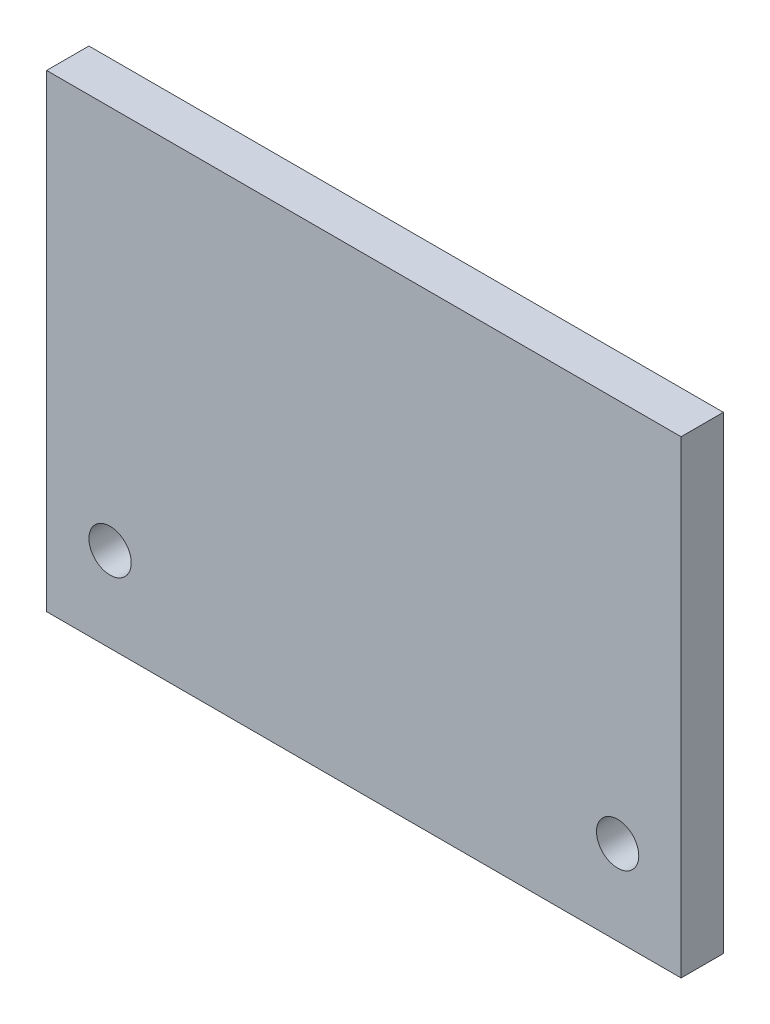
ISO-10303-21;
HEADER;
FILE_DESCRIPTION(('STEP AP214'),'2;1');
FILE_NAME('part.step','',(''),(''),'','','');
FILE_SCHEMA(('AUTOMOTIVE_DESIGN { 1 0 10303 214 1 1 1 1 }'));
ENDSEC;
DATA;
#1=APPLICATION_CONTEXT('core data for automotive mechanical design processes');
#2=APPLICATION_PROTOCOL_DEFINITION('international standard','automotive_design',2000,#1);
#3=PRODUCT_CONTEXT('',#1,'mechanical');
#4=PRODUCT('Part','Part','',(#3));
#5=PRODUCT_RELATED_PRODUCT_CATEGORY('part','',(#4));
#6=PRODUCT_DEFINITION_FORMATION('','',#4);
#7=PRODUCT_DEFINITION_CONTEXT('part definition',#1,'design');
#8=PRODUCT_DEFINITION('design','',#6,#7);
#9=PRODUCT_DEFINITION_SHAPE('','',#8);
#10=(LENGTH_UNIT() NAMED_UNIT(*) SI_UNIT(.MILLI.,.METRE.));
#11=(NAMED_UNIT(*) PLANE_ANGLE_UNIT() SI_UNIT($,.RADIAN.));
#12=(NAMED_UNIT(*) SI_UNIT($,.STERADIAN.) SOLID_ANGLE_UNIT());
#13=UNCERTAINTY_MEASURE_WITH_UNIT(LENGTH_MEASURE(1.E-05),#10,'distance_accuracy_value','');
#14=(GEOMETRIC_REPRESENTATION_CONTEXT(3) GLOBAL_UNCERTAINTY_ASSIGNED_CONTEXT((#13)) GLOBAL_UNIT_ASSIGNED_CONTEXT((#10,
#11,#12)) REPRESENTATION_CONTEXT('',''));
#15=CARTESIAN_POINT('',(0.,0.,0.));
#16=DIRECTION('',(0.,0.,1.));
#17=DIRECTION('',(1.,0.,0.));
#18=AXIS2_PLACEMENT_3D('',#15,#16,#17);
#19=CARTESIAN_POINT('',(-6.35,98.5775396286338,-6.35));
#20=DIRECTION('',(-1.,0.,0.));
#21=DIRECTION('',(0.,0.,1.));
#22=AXIS2_PLACEMENT_3D('',#19,#20,#21);
#23=PLANE('',#22);
#24=DIRECTION('',(0.,-1.,0.));
#25=VECTOR('',#24,1.);
#26=CARTESIAN_POINT('',(-6.35,98.5775396286338,0.));
#27=LINE('',#26,#25);
#28=CARTESIAN_POINT('',(-6.35,98.5775396286338,0.));
#29=VERTEX_POINT('',#28);
#30=CARTESIAN_POINT('',(-6.35,28.2029783203332,0.));
#31=VERTEX_POINT('',#30);
#32=EDGE_CURVE('E99',#29,#31,#27,.T.);
#33=ORIENTED_EDGE('',*,*,#32,.F.);
#34=DIRECTION('',(0.,0.,1.));
#35=VECTOR('',#34,1.);
#36=CARTESIAN_POINT('',(-6.35,98.5775396286338,-6.35));
#37=LINE('',#36,#35);
#38=CARTESIAN_POINT('',(-6.35,98.5775396286338,-6.35));
#39=VERTEX_POINT('',#38);
#40=EDGE_CURVE('E11',#39,#29,#37,.T.);
#41=ORIENTED_EDGE('',*,*,#40,.F.);
#42=DIRECTION('',(0.,-1.,0.));
#43=VECTOR('',#42,1.);
#44=CARTESIAN_POINT('',(-6.35,98.5775396286338,-6.35));
#45=LINE('',#44,#43);
#46=CARTESIAN_POINT('',(-6.35,28.2029783203332,-6.35));
#47=VERTEX_POINT('',#46);
#48=EDGE_CURVE('E93',#39,#47,#45,.T.);
#49=ORIENTED_EDGE('',*,*,#48,.T.);
#50=DIRECTION('',(0.,0.,1.));
#51=VECTOR('',#50,1.);
#52=CARTESIAN_POINT('',(-6.35,28.2029783203332,-6.35));
#53=LINE('',#52,#51);
#54=EDGE_CURVE('E36',#47,#31,#53,.T.);
#55=ORIENTED_EDGE('',*,*,#54,.T.);
#56=EDGE_LOOP('',(#33,#41,#49,#55));
#57=FACE_BOUND('',#56,.T.);
#58=ADVANCED_FACE('F33',(#57),#23,.T.);
#59=CARTESIAN_POINT('',(-6.35,98.5775396286338,-6.35));
#60=DIRECTION('',(0.,-1.,0.));
#61=DIRECTION('',(0.,0.,-1.));
#62=AXIS2_PLACEMENT_3D('',#59,#60,#61);
#63=PLANE('',#62);
#64=DIRECTION('',(1.,0.,0.));
#65=VECTOR('',#64,1.);
#66=CARTESIAN_POINT('',(-6.35,98.5775396286338,0.));
#67=LINE('',#66,#65);
#68=CARTESIAN_POINT('',(88.9,98.5775396286338,0.));
#69=VERTEX_POINT('',#68);
#70=EDGE_CURVE('E66',#29,#69,#67,.T.);
#71=ORIENTED_EDGE('',*,*,#70,.T.);
#72=DIRECTION('',(0.,0.,1.));
#73=VECTOR('',#72,1.);
#74=CARTESIAN_POINT('',(88.9,98.5775396286338,-6.35));
#75=LINE('',#74,#73);
#76=CARTESIAN_POINT('',(88.9,98.5775396286338,-6.35));
#77=VERTEX_POINT('',#76);
#78=EDGE_CURVE('E42',#77,#69,#75,.T.);
#79=ORIENTED_EDGE('',*,*,#78,.F.);
#80=DIRECTION('',(1.,0.,0.));
#81=VECTOR('',#80,1.);
#82=CARTESIAN_POINT('',(-6.35,98.5775396286338,-6.35));
#83=LINE('',#82,#81);
#84=EDGE_CURVE('E83',#39,#77,#83,.T.);
#85=ORIENTED_EDGE('',*,*,#84,.F.);
#86=ORIENTED_EDGE('',*,*,#40,.T.);
#87=EDGE_LOOP('',(#71,#79,#85,#86));
#88=FACE_BOUND('',#87,.T.);
#89=ADVANCED_FACE('F110',(#88),#63,.F.);
#90=CARTESIAN_POINT('',(88.9,98.5775396286338,-6.35));
#91=DIRECTION('',(-1.,0.,0.));
#92=DIRECTION('',(0.,0.,1.));
#93=AXIS2_PLACEMENT_3D('',#90,#91,#92);
#94=PLANE('',#93);
#95=DIRECTION('',(0.,-1.,0.));
#96=VECTOR('',#95,1.);
#97=CARTESIAN_POINT('',(88.9,98.5775396286338,0.));
#98=LINE('',#97,#96);
#99=CARTESIAN_POINT('',(88.9,28.2029783203332,0.));
#100=VERTEX_POINT('',#99);
#101=EDGE_CURVE('E90',#69,#100,#98,.T.);
#102=ORIENTED_EDGE('',*,*,#101,.T.);
#103=DIRECTION('',(0.,0.,1.));
#104=VECTOR('',#103,1.);
#105=CARTESIAN_POINT('',(88.9,28.2029783203332,-6.35));
#106=LINE('',#105,#104);
#107=CARTESIAN_POINT('',(88.9,28.2029783203332,-6.35));
#108=VERTEX_POINT('',#107);
#109=EDGE_CURVE('E87',#108,#100,#106,.T.);
#110=ORIENTED_EDGE('',*,*,#109,.F.);
#111=DIRECTION('',(0.,-1.,0.));
#112=VECTOR('',#111,1.);
#113=CARTESIAN_POINT('',(88.9,98.5775396286338,-6.35));
#114=LINE('',#113,#112);
#115=EDGE_CURVE('E78',#77,#108,#114,.T.);
#116=ORIENTED_EDGE('',*,*,#115,.F.);
#117=ORIENTED_EDGE('',*,*,#78,.T.);
#118=EDGE_LOOP('',(#102,#110,#116,#117));
#119=FACE_BOUND('',#118,.T.);
#120=ADVANCED_FACE('F88',(#119),#94,.F.);
#121=CARTESIAN_POINT('',(-6.35,28.2029783203332,-6.35));
#122=DIRECTION('',(0.,-1.,0.));
#123=DIRECTION('',(0.,0.,-1.));
#124=AXIS2_PLACEMENT_3D('',#121,#122,#123);
#125=PLANE('',#124);
#126=DIRECTION('',(1.,0.,0.));
#127=VECTOR('',#126,1.);
#128=CARTESIAN_POINT('',(-6.35,28.2029783203332,0.));
#129=LINE('',#128,#127);
#130=EDGE_CURVE('E102',#31,#100,#129,.T.);
#131=ORIENTED_EDGE('',*,*,#130,.F.);
#132=ORIENTED_EDGE('',*,*,#54,.F.);
#133=DIRECTION('',(1.,0.,0.));
#134=VECTOR('',#133,1.);
#135=CARTESIAN_POINT('',(-6.35,28.2029783203332,-6.35));
#136=LINE('',#135,#134);
#137=EDGE_CURVE('E82',#47,#108,#136,.T.);
#138=ORIENTED_EDGE('',*,*,#137,.T.);
#139=ORIENTED_EDGE('',*,*,#109,.T.);
#140=EDGE_LOOP('',(#131,#132,#138,#139));
#141=FACE_BOUND('',#140,.T.);
#142=ADVANCED_FACE('F92',(#141),#125,.T.);
#143=CARTESIAN_POINT('',(0.,0.,-6.35));
#144=DIRECTION('',(0.,0.,1.));
#145=DIRECTION('',(1.,0.,0.));
#146=AXIS2_PLACEMENT_3D('',#143,#144,#145);
#147=PLANE('',#146);
#148=CARTESIAN_POINT('',(3.175,40.9029783203332,-6.35));
#149=DIRECTION('',(0.,0.,1.));
#150=DIRECTION('',(1.,0.,0.));
#151=AXIS2_PLACEMENT_3D('',#148,#149,#150);
#152=CIRCLE('',#151,3.175);
#153=CARTESIAN_POINT('',(6.35,40.9029783203332,-6.35));
#154=VERTEX_POINT('',#153);
#155=EDGE_CURVE('E144',#154,#154,#152,.T.);
#156=ORIENTED_EDGE('',*,*,#155,.T.);
#157=EDGE_LOOP('',(#156));
#158=FACE_BOUND('',#157,.T.);
#159=CARTESIAN_POINT('',(79.375,40.9029783203332,-6.35));
#160=DIRECTION('',(0.,0.,1.));
#161=DIRECTION('',(1.,0.,0.));
#162=AXIS2_PLACEMENT_3D('',#159,#160,#161);
#163=CIRCLE('',#162,3.175);
#164=CARTESIAN_POINT('',(82.55,40.9029783203332,-6.35));
#165=VERTEX_POINT('',#164);
#166=EDGE_CURVE('E103',#165,#165,#163,.T.);
#167=ORIENTED_EDGE('',*,*,#166,.T.);
#168=EDGE_LOOP('',(#167));
#169=FACE_BOUND('',#168,.T.);
#170=ORIENTED_EDGE('',*,*,#48,.F.);
#171=ORIENTED_EDGE('',*,*,#84,.T.);
#172=ORIENTED_EDGE('',*,*,#115,.T.);
#173=ORIENTED_EDGE('',*,*,#137,.F.);
#174=EDGE_LOOP('',(#170,#171,#172,#173));
#175=FACE_BOUND('',#174,.T.);
#176=ADVANCED_FACE('F81',(#158,#169,#175),#147,.F.);
#177=CARTESIAN_POINT('',(0.,0.,0.));
#178=DIRECTION('',(0.,0.,1.));
#179=DIRECTION('',(1.,0.,0.));
#180=AXIS2_PLACEMENT_3D('',#177,#178,#179);
#181=PLANE('',#180);
#182=CARTESIAN_POINT('',(3.175,40.9029783203332,0.));
#183=DIRECTION('',(0.,0.,1.));
#184=DIRECTION('',(1.,0.,0.));
#185=AXIS2_PLACEMENT_3D('',#182,#183,#184);
#186=CIRCLE('',#185,3.175);
#187=CARTESIAN_POINT('',(6.35,40.9029783203332,0.));
#188=VERTEX_POINT('',#187);
#189=EDGE_CURVE('E147',#188,#188,#186,.T.);
#190=ORIENTED_EDGE('',*,*,#189,.F.);
#191=EDGE_LOOP('',(#190));
#192=FACE_BOUND('',#191,.T.);
#193=CARTESIAN_POINT('',(79.375,40.9029783203332,0.));
#194=DIRECTION('',(0.,0.,1.));
#195=DIRECTION('',(1.,0.,0.));
#196=AXIS2_PLACEMENT_3D('',#193,#194,#195);
#197=CIRCLE('',#196,3.175);
#198=CARTESIAN_POINT('',(82.55,40.9029783203332,0.));
#199=VERTEX_POINT('',#198);
#200=EDGE_CURVE('E149',#199,#199,#197,.T.);
#201=ORIENTED_EDGE('',*,*,#200,.F.);
#202=EDGE_LOOP('',(#201));
#203=FACE_BOUND('',#202,.T.);
#204=ORIENTED_EDGE('',*,*,#32,.T.);
#205=ORIENTED_EDGE('',*,*,#130,.T.);
#206=ORIENTED_EDGE('',*,*,#101,.F.);
#207=ORIENTED_EDGE('',*,*,#70,.F.);
#208=EDGE_LOOP('',(#204,#205,#206,#207));
#209=FACE_BOUND('',#208,.T.);
#210=ADVANCED_FACE('F108',(#192,#203,#209),#181,.T.);
#211=CARTESIAN_POINT('',(79.375,40.9029783203332,-6.35));
#212=DIRECTION('',(0.,0.,1.));
#213=DIRECTION('',(1.,0.,0.));
#214=AXIS2_PLACEMENT_3D('',#211,#212,#213);
#215=CYLINDRICAL_SURFACE('',#214,3.175);
#216=ORIENTED_EDGE('',*,*,#166,.F.);
#217=EDGE_LOOP('',(#216));
#218=FACE_BOUND('',#217,.T.);
#219=ORIENTED_EDGE('',*,*,#200,.T.);
#220=EDGE_LOOP('',(#219));
#221=FACE_BOUND('',#220,.T.);
#222=ADVANCED_FACE('F129',(#218,#221),#215,.F.);
#223=CARTESIAN_POINT('',(3.175,40.9029783203332,-6.35));
#224=DIRECTION('',(0.,0.,1.));
#225=DIRECTION('',(1.,0.,0.));
#226=AXIS2_PLACEMENT_3D('',#223,#224,#225);
#227=CYLINDRICAL_SURFACE('',#226,3.175);
#228=ORIENTED_EDGE('',*,*,#155,.F.);
#229=EDGE_LOOP('',(#228));
#230=FACE_BOUND('',#229,.T.);
#231=ORIENTED_EDGE('',*,*,#189,.T.);
#232=EDGE_LOOP('',(#231));
#233=FACE_BOUND('',#232,.T.);
#234=ADVANCED_FACE('F136',(#230,#233),#227,.F.);
#235=CLOSED_SHELL('',(#58,#89,#120,#142,#176,#210,#222,#234));
#236=MANIFOLD_SOLID_BREP('B2',#235);
#237=ADVANCED_BREP_SHAPE_REPRESENTATION('',(#18,#236),#14);
#238=SHAPE_DEFINITION_REPRESENTATION(#9,#237);
ENDSEC;
END-ISO-10303-21;
